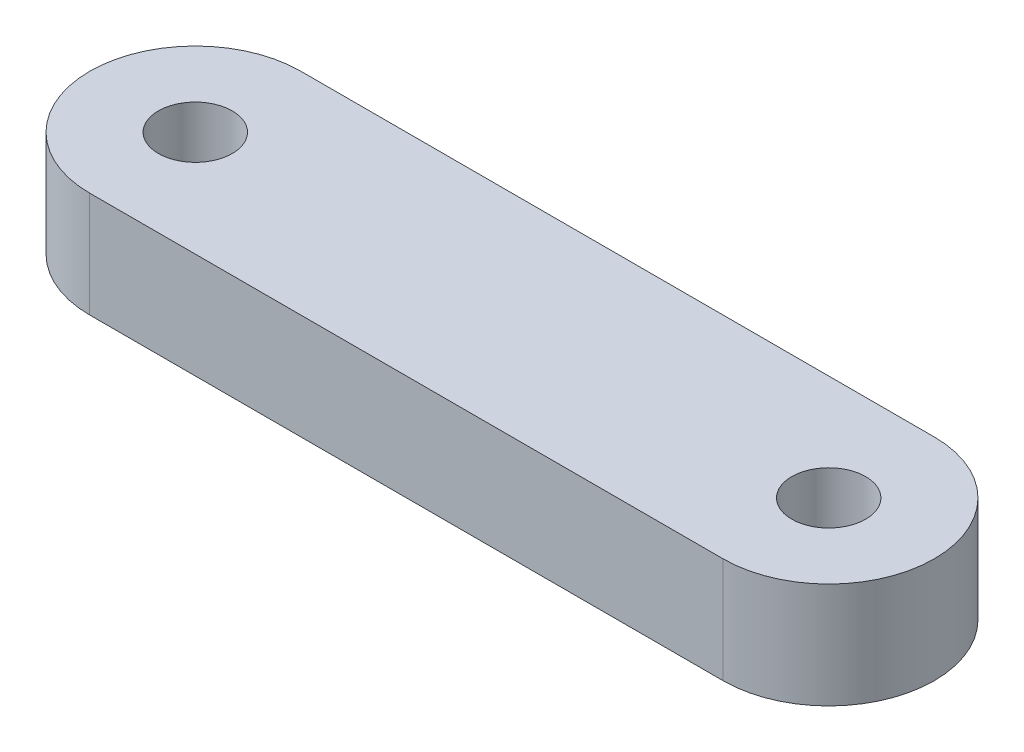
ISO-10303-21;
HEADER;
FILE_DESCRIPTION(('STEP AP214'),'2;1');
FILE_NAME('part.step','',(''),(''),'','','');
FILE_SCHEMA(('AUTOMOTIVE_DESIGN { 1 0 10303 214 1 1 1 1 }'));
ENDSEC;
DATA;
#1=APPLICATION_CONTEXT('core data for automotive mechanical design processes');
#2=APPLICATION_PROTOCOL_DEFINITION('international standard','automotive_design',2000,#1);
#3=PRODUCT_CONTEXT('',#1,'mechanical');
#4=PRODUCT('Part','Part','',(#3));
#5=PRODUCT_RELATED_PRODUCT_CATEGORY('part','',(#4));
#6=PRODUCT_DEFINITION_FORMATION('','',#4);
#7=PRODUCT_DEFINITION_CONTEXT('part definition',#1,'design');
#8=PRODUCT_DEFINITION('design','',#6,#7);
#9=PRODUCT_DEFINITION_SHAPE('','',#8);
#10=(LENGTH_UNIT() NAMED_UNIT(*) SI_UNIT(.MILLI.,.METRE.));
#11=(NAMED_UNIT(*) PLANE_ANGLE_UNIT() SI_UNIT($,.RADIAN.));
#12=(NAMED_UNIT(*) SI_UNIT($,.STERADIAN.) SOLID_ANGLE_UNIT());
#13=UNCERTAINTY_MEASURE_WITH_UNIT(LENGTH_MEASURE(1.E-05),#10,'distance_accuracy_value','');
#14=(GEOMETRIC_REPRESENTATION_CONTEXT(3) GLOBAL_UNCERTAINTY_ASSIGNED_CONTEXT((#13)) GLOBAL_UNIT_ASSIGNED_CONTEXT((#10,
#11,#12)) REPRESENTATION_CONTEXT('',''));
#15=CARTESIAN_POINT('',(0.,0.,0.));
#16=DIRECTION('',(0.,0.,1.));
#17=DIRECTION('',(1.,0.,0.));
#18=AXIS2_PLACEMENT_3D('',#15,#16,#17);
#19=CARTESIAN_POINT('',(0.,5.,-5.));
#20=DIRECTION('',(0.,1.,0.));
#21=DIRECTION('',(0.,0.,1.));
#22=AXIS2_PLACEMENT_3D('',#19,#20,#21);
#23=PLANE('',#22);
#24=CARTESIAN_POINT('',(0.,5.,-5.));
#25=DIRECTION('',(0.,1.,0.));
#26=DIRECTION('',(0.,0.,1.));
#27=AXIS2_PLACEMENT_3D('',#24,#25,#26);
#28=CIRCLE('',#27,1.75);
#29=CARTESIAN_POINT('',(0.,5.,-3.25));
#30=VERTEX_POINT('',#29);
#31=EDGE_CURVE('E100',#30,#30,#28,.T.);
#32=ORIENTED_EDGE('',*,*,#31,.F.);
#33=EDGE_LOOP('',(#32));
#34=FACE_BOUND('',#33,.T.);
#35=CARTESIAN_POINT('',(0.,5.,-5.));
#36=DIRECTION('',(0.,1.,0.));
#37=DIRECTION('',(0.,0.,1.));
#38=AXIS2_PLACEMENT_3D('',#35,#36,#37);
#39=CIRCLE('',#38,5.);
#40=CARTESIAN_POINT('',(0.,5.,-10.));
#41=VERTEX_POINT('',#40);
#42=CARTESIAN_POINT('',(0.,5.,0.));
#43=VERTEX_POINT('',#42);
#44=EDGE_CURVE('E85',#41,#43,#39,.T.);
#45=ORIENTED_EDGE('',*,*,#44,.T.);
#46=DIRECTION('',(1.,0.,0.));
#47=VECTOR('',#46,1.);
#48=CARTESIAN_POINT('',(0.,5.,0.));
#49=LINE('',#48,#47);
#50=CARTESIAN_POINT('',(30.,5.,0.));
#51=VERTEX_POINT('',#50);
#52=EDGE_CURVE('E80',#43,#51,#49,.T.);
#53=ORIENTED_EDGE('',*,*,#52,.T.);
#54=CARTESIAN_POINT('',(30.,5.,-5.00000000000001));
#55=DIRECTION('',(0.,1.,0.));
#56=DIRECTION('',(0.,0.,-1.));
#57=AXIS2_PLACEMENT_3D('',#54,#55,#56);
#58=CIRCLE('',#57,5.);
#59=CARTESIAN_POINT('',(30.,5.,-10.));
#60=VERTEX_POINT('',#59);
#61=EDGE_CURVE('E83',#51,#60,#58,.T.);
#62=ORIENTED_EDGE('',*,*,#61,.T.);
#63=DIRECTION('',(-1.,0.,0.));
#64=VECTOR('',#63,1.);
#65=CARTESIAN_POINT('',(30.,5.,-10.));
#66=LINE('',#65,#64);
#67=EDGE_CURVE('E50',#60,#41,#66,.T.);
#68=ORIENTED_EDGE('',*,*,#67,.T.);
#69=EDGE_LOOP('',(#45,#53,#62,#68));
#70=FACE_BOUND('',#69,.T.);
#71=CARTESIAN_POINT('',(30.,5.,-5.00000000000001));
#72=DIRECTION('',(0.,1.,0.));
#73=DIRECTION('',(0.,0.,1.));
#74=AXIS2_PLACEMENT_3D('',#71,#72,#73);
#75=CIRCLE('',#74,1.75);
#76=CARTESIAN_POINT('',(30.,5.,-3.25));
#77=VERTEX_POINT('',#76);
#78=EDGE_CURVE('E115',#77,#77,#75,.T.);
#79=ORIENTED_EDGE('',*,*,#78,.F.);
#80=EDGE_LOOP('',(#79));
#81=FACE_BOUND('',#80,.T.);
#82=ADVANCED_FACE('F33',(#34,#70,#81),#23,.T.);
#83=CARTESIAN_POINT('',(0.,0.,-5.));
#84=DIRECTION('',(0.,1.,0.));
#85=DIRECTION('',(0.,0.,1.));
#86=AXIS2_PLACEMENT_3D('',#83,#84,#85);
#87=PLANE('',#86);
#88=CARTESIAN_POINT('',(0.,0.,-5.));
#89=DIRECTION('',(0.,1.,0.));
#90=DIRECTION('',(0.,0.,1.));
#91=AXIS2_PLACEMENT_3D('',#88,#89,#90);
#92=CIRCLE('',#91,1.75);
#93=CARTESIAN_POINT('',(0.,0.,-3.25));
#94=VERTEX_POINT('',#93);
#95=EDGE_CURVE('E112',#94,#94,#92,.T.);
#96=ORIENTED_EDGE('',*,*,#95,.T.);
#97=EDGE_LOOP('',(#96));
#98=FACE_BOUND('',#97,.T.);
#99=CARTESIAN_POINT('',(0.,0.,-5.));
#100=DIRECTION('',(0.,1.,0.));
#101=DIRECTION('',(0.,0.,1.));
#102=AXIS2_PLACEMENT_3D('',#99,#100,#101);
#103=CIRCLE('',#102,5.);
#104=CARTESIAN_POINT('',(0.,0.,-10.));
#105=VERTEX_POINT('',#104);
#106=CARTESIAN_POINT('',(0.,0.,0.));
#107=VERTEX_POINT('',#106);
#108=EDGE_CURVE('E97',#105,#107,#103,.T.);
#109=ORIENTED_EDGE('',*,*,#108,.F.);
#110=DIRECTION('',(-1.,0.,0.));
#111=VECTOR('',#110,1.);
#112=CARTESIAN_POINT('',(30.,0.,-10.));
#113=LINE('',#112,#111);
#114=CARTESIAN_POINT('',(30.,0.,-10.));
#115=VERTEX_POINT('',#114);
#116=EDGE_CURVE('E73',#115,#105,#113,.T.);
#117=ORIENTED_EDGE('',*,*,#116,.F.);
#118=CARTESIAN_POINT('',(30.,0.,-5.00000000000001));
#119=DIRECTION('',(0.,1.,0.));
#120=DIRECTION('',(0.,0.,-1.));
#121=AXIS2_PLACEMENT_3D('',#118,#119,#120);
#122=CIRCLE('',#121,5.);
#123=CARTESIAN_POINT('',(30.,0.,0.));
#124=VERTEX_POINT('',#123);
#125=EDGE_CURVE('E67',#124,#115,#122,.T.);
#126=ORIENTED_EDGE('',*,*,#125,.F.);
#127=DIRECTION('',(1.,0.,0.));
#128=VECTOR('',#127,1.);
#129=CARTESIAN_POINT('',(0.,0.,0.));
#130=LINE('',#129,#128);
#131=EDGE_CURVE('E89',#107,#124,#130,.T.);
#132=ORIENTED_EDGE('',*,*,#131,.F.);
#133=EDGE_LOOP('',(#109,#117,#126,#132));
#134=FACE_BOUND('',#133,.T.);
#135=CARTESIAN_POINT('',(30.,0.,-5.00000000000001));
#136=DIRECTION('',(0.,1.,0.));
#137=DIRECTION('',(0.,0.,1.));
#138=AXIS2_PLACEMENT_3D('',#135,#136,#137);
#139=CIRCLE('',#138,1.75);
#140=CARTESIAN_POINT('',(30.,0.,-3.25));
#141=VERTEX_POINT('',#140);
#142=EDGE_CURVE('E118',#141,#141,#139,.T.);
#143=ORIENTED_EDGE('',*,*,#142,.T.);
#144=EDGE_LOOP('',(#143));
#145=FACE_BOUND('',#144,.T.);
#146=ADVANCED_FACE('F108',(#98,#134,#145),#87,.F.);
#147=CARTESIAN_POINT('',(0.,5.,-5.));
#148=DIRECTION('',(0.,-1.,0.));
#149=DIRECTION('',(0.,0.,-1.));
#150=AXIS2_PLACEMENT_3D('',#147,#148,#149);
#151=CYLINDRICAL_SURFACE('',#150,5.);
#152=ORIENTED_EDGE('',*,*,#108,.T.);
#153=DIRECTION('',(0.,-1.,0.));
#154=VECTOR('',#153,1.);
#155=CARTESIAN_POINT('',(0.,5.,0.));
#156=LINE('',#155,#154);
#157=EDGE_CURVE('E11',#43,#107,#156,.T.);
#158=ORIENTED_EDGE('',*,*,#157,.F.);
#159=ORIENTED_EDGE('',*,*,#44,.F.);
#160=DIRECTION('',(0.,-1.,0.));
#161=VECTOR('',#160,1.);
#162=CARTESIAN_POINT('',(0.,5.,-10.));
#163=LINE('',#162,#161);
#164=EDGE_CURVE('E93',#41,#105,#163,.T.);
#165=ORIENTED_EDGE('',*,*,#164,.T.);
#166=EDGE_LOOP('',(#152,#158,#159,#165));
#167=FACE_BOUND('',#166,.T.);
#168=ADVANCED_FACE('F35',(#167),#151,.T.);
#169=CARTESIAN_POINT('',(0.,5.,0.));
#170=DIRECTION('',(0.,0.,-1.));
#171=DIRECTION('',(-1.,0.,0.));
#172=AXIS2_PLACEMENT_3D('',#169,#170,#171);
#173=PLANE('',#172);
#174=ORIENTED_EDGE('',*,*,#131,.T.);
#175=DIRECTION('',(0.,-1.,0.));
#176=VECTOR('',#175,1.);
#177=CARTESIAN_POINT('',(30.,5.,0.));
#178=LINE('',#177,#176);
#179=EDGE_CURVE('E42',#51,#124,#178,.T.);
#180=ORIENTED_EDGE('',*,*,#179,.F.);
#181=ORIENTED_EDGE('',*,*,#52,.F.);
#182=ORIENTED_EDGE('',*,*,#157,.T.);
#183=EDGE_LOOP('',(#174,#180,#181,#182));
#184=FACE_BOUND('',#183,.T.);
#185=ADVANCED_FACE('F88',(#184),#173,.F.);
#186=CARTESIAN_POINT('',(30.,5.,-5.00000000000001));
#187=DIRECTION('',(0.,-1.,0.));
#188=DIRECTION('',(0.,0.,-1.));
#189=AXIS2_PLACEMENT_3D('',#186,#187,#188);
#190=CYLINDRICAL_SURFACE('',#189,5.);
#191=ORIENTED_EDGE('',*,*,#125,.T.);
#192=DIRECTION('',(0.,-1.,0.));
#193=VECTOR('',#192,1.);
#194=CARTESIAN_POINT('',(30.,5.,-10.));
#195=LINE('',#194,#193);
#196=EDGE_CURVE('E90',#60,#115,#195,.T.);
#197=ORIENTED_EDGE('',*,*,#196,.F.);
#198=ORIENTED_EDGE('',*,*,#61,.F.);
#199=ORIENTED_EDGE('',*,*,#179,.T.);
#200=EDGE_LOOP('',(#191,#197,#198,#199));
#201=FACE_BOUND('',#200,.T.);
#202=ADVANCED_FACE('F91',(#201),#190,.T.);
#203=CARTESIAN_POINT('',(30.,5.,-10.));
#204=DIRECTION('',(0.,0.,1.));
#205=DIRECTION('',(1.,0.,0.));
#206=AXIS2_PLACEMENT_3D('',#203,#204,#205);
#207=PLANE('',#206);
#208=ORIENTED_EDGE('',*,*,#116,.T.);
#209=ORIENTED_EDGE('',*,*,#164,.F.);
#210=ORIENTED_EDGE('',*,*,#67,.F.);
#211=ORIENTED_EDGE('',*,*,#196,.T.);
#212=EDGE_LOOP('',(#208,#209,#210,#211));
#213=FACE_BOUND('',#212,.T.);
#214=ADVANCED_FACE('F105',(#213),#207,.F.);
#215=CARTESIAN_POINT('',(0.,5.,-5.));
#216=DIRECTION('',(0.,-1.,0.));
#217=DIRECTION('',(0.,0.,-1.));
#218=AXIS2_PLACEMENT_3D('',#215,#216,#217);
#219=CYLINDRICAL_SURFACE('',#218,1.75);
#220=ORIENTED_EDGE('',*,*,#31,.T.);
#221=EDGE_LOOP('',(#220));
#222=FACE_BOUND('',#221,.T.);
#223=ORIENTED_EDGE('',*,*,#95,.F.);
#224=EDGE_LOOP('',(#223));
#225=FACE_BOUND('',#224,.T.);
#226=ADVANCED_FACE('F136',(#222,#225),#219,.F.);
#227=CARTESIAN_POINT('',(30.,5.,-5.00000000000001));
#228=DIRECTION('',(0.,-1.,0.));
#229=DIRECTION('',(0.,0.,-1.));
#230=AXIS2_PLACEMENT_3D('',#227,#228,#229);
#231=CYLINDRICAL_SURFACE('',#230,1.75);
#232=ORIENTED_EDGE('',*,*,#78,.T.);
#233=EDGE_LOOP('',(#232));
#234=FACE_BOUND('',#233,.T.);
#235=ORIENTED_EDGE('',*,*,#142,.F.);
#236=EDGE_LOOP('',(#235));
#237=FACE_BOUND('',#236,.T.);
#238=ADVANCED_FACE('F124',(#234,#237),#231,.F.);
#239=CLOSED_SHELL('',(#82,#146,#168,#185,#202,#214,#226,#238));
#240=MANIFOLD_SOLID_BREP('B2',#239);
#241=ADVANCED_BREP_SHAPE_REPRESENTATION('',(#18,#240),#14);
#242=SHAPE_DEFINITION_REPRESENTATION(#9,#241);
ENDSEC;
END-ISO-10303-21;
